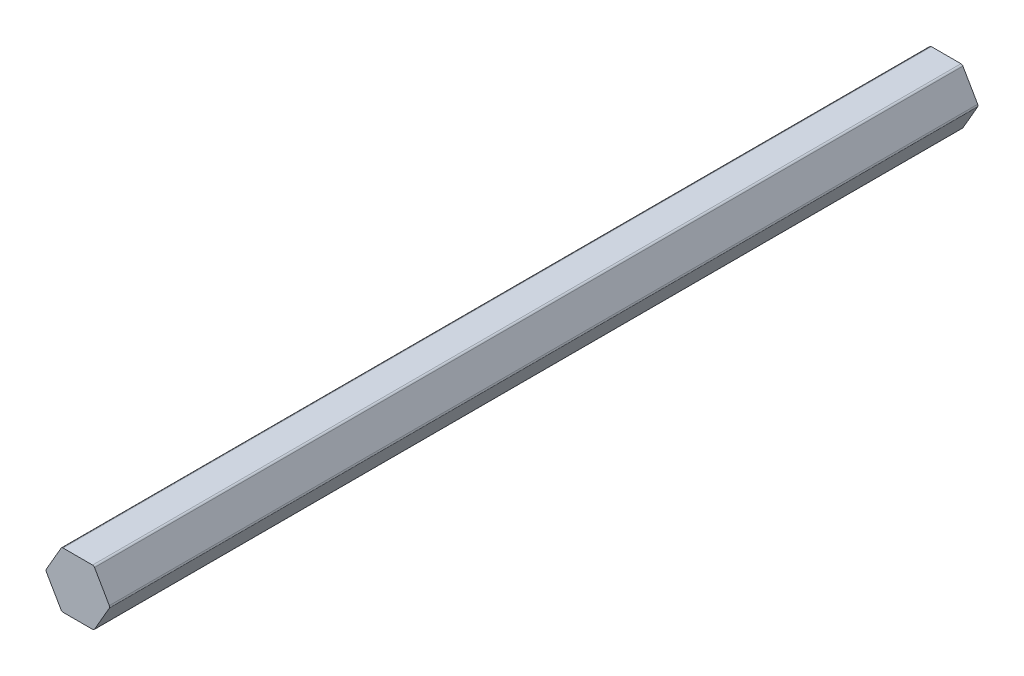
ISO-10303-21;
HEADER;
FILE_DESCRIPTION(('STEP AP214'),'2;1');
FILE_NAME('part.step','',(''),(''),'','','');
FILE_SCHEMA(('AUTOMOTIVE_DESIGN { 1 0 10303 214 1 1 1 1 }'));
ENDSEC;
DATA;
#1=APPLICATION_CONTEXT('core data for automotive mechanical design processes');
#2=APPLICATION_PROTOCOL_DEFINITION('international standard','automotive_design',2000,#1);
#3=PRODUCT_CONTEXT('',#1,'mechanical');
#4=PRODUCT('Part','Part','',(#3));
#5=PRODUCT_RELATED_PRODUCT_CATEGORY('part','',(#4));
#6=PRODUCT_DEFINITION_FORMATION('','',#4);
#7=PRODUCT_DEFINITION_CONTEXT('part definition',#1,'design');
#8=PRODUCT_DEFINITION('design','',#6,#7);
#9=PRODUCT_DEFINITION_SHAPE('','',#8);
#10=(LENGTH_UNIT() NAMED_UNIT(*) SI_UNIT(.MILLI.,.METRE.));
#11=(NAMED_UNIT(*) PLANE_ANGLE_UNIT() SI_UNIT($,.RADIAN.));
#12=(NAMED_UNIT(*) SI_UNIT($,.STERADIAN.) SOLID_ANGLE_UNIT());
#13=UNCERTAINTY_MEASURE_WITH_UNIT(LENGTH_MEASURE(1.E-05),#10,'distance_accuracy_value','');
#14=(GEOMETRIC_REPRESENTATION_CONTEXT(3) GLOBAL_UNCERTAINTY_ASSIGNED_CONTEXT((#13)) GLOBAL_UNIT_ASSIGNED_CONTEXT((#10,
#11,#12)) REPRESENTATION_CONTEXT('',''));
#15=CARTESIAN_POINT('',(0.,0.,0.));
#16=DIRECTION('',(0.,0.,1.));
#17=DIRECTION('',(1.,0.,0.));
#18=AXIS2_PLACEMENT_3D('',#15,#16,#17);
#19=CARTESIAN_POINT('',(-3.36554792418708,-5.8293,-30.988));
#20=DIRECTION('',(0.,0.,-1.));
#21=DIRECTION('',(-1.,0.,0.));
#22=AXIS2_PLACEMENT_3D('',#19,#20,#21);
#23=CYLINDRICAL_SURFACE('',#22,0.507999999999999);
#24=CARTESIAN_POINT('',(-3.36554792418708,-5.8293,-228.6));
#25=DIRECTION('',(0.,0.,-1.));
#26=DIRECTION('',(-1.,0.,0.));
#27=AXIS2_PLACEMENT_3D('',#24,#25,#26);
#28=CIRCLE('',#27,0.507999999999999);
#29=CARTESIAN_POINT('',(-3.36554792418708,-6.3373,-228.6));
#30=VERTEX_POINT('',#29);
#31=CARTESIAN_POINT('',(-3.80548882930957,-6.0833,-228.6));
#32=VERTEX_POINT('',#31);
#33=EDGE_CURVE('E154',#30,#32,#28,.T.);
#34=ORIENTED_EDGE('',*,*,#33,.F.);
#35=DIRECTION('',(0.,0.,-1.));
#36=VECTOR('',#35,1.);
#37=CARTESIAN_POINT('',(-3.36554792418708,-6.3373,-30.988));
#38=LINE('',#37,#36);
#39=CARTESIAN_POINT('',(-3.36554792418708,-6.3373,-30.988));
#40=VERTEX_POINT('',#39);
#41=EDGE_CURVE('E11',#40,#30,#38,.T.);
#42=ORIENTED_EDGE('',*,*,#41,.F.);
#43=CARTESIAN_POINT('',(-3.36554792418708,-5.8293,-30.988));
#44=DIRECTION('',(0.,0.,-1.));
#45=DIRECTION('',(-1.,0.,0.));
#46=AXIS2_PLACEMENT_3D('',#43,#44,#45);
#47=CIRCLE('',#46,0.507999999999999);
#48=CARTESIAN_POINT('',(-3.80548882930957,-6.0833,-30.988));
#49=VERTEX_POINT('',#48);
#50=EDGE_CURVE('E186',#40,#49,#47,.T.);
#51=ORIENTED_EDGE('',*,*,#50,.T.);
#52=DIRECTION('',(0.,0.,-1.));
#53=VECTOR('',#52,1.);
#54=CARTESIAN_POINT('',(-3.80548882930957,-6.0833,-30.988));
#55=LINE('',#54,#53);
#56=EDGE_CURVE('E36',#49,#32,#55,.T.);
#57=ORIENTED_EDGE('',*,*,#56,.T.);
#58=EDGE_LOOP('',(#34,#42,#51,#57));
#59=FACE_BOUND('',#58,.T.);
#60=ADVANCED_FACE('F33',(#59),#23,.T.);
#61=CARTESIAN_POINT('',(3.36554792418708,-6.3373,-30.988));
#62=DIRECTION('',(0.,-1.,0.));
#63=DIRECTION('',(1.,0.,0.));
#64=AXIS2_PLACEMENT_3D('',#61,#62,#63);
#65=PLANE('',#64);
#66=DIRECTION('',(-1.,0.,0.));
#67=VECTOR('',#66,1.);
#68=CARTESIAN_POINT('',(3.36554792418708,-6.3373,-228.6));
#69=LINE('',#68,#67);
#70=CARTESIAN_POINT('',(3.36554792418708,-6.3373,-228.6));
#71=VERTEX_POINT('',#70);
#72=EDGE_CURVE('E184',#71,#30,#69,.T.);
#73=ORIENTED_EDGE('',*,*,#72,.F.);
#74=DIRECTION('',(0.,0.,-1.));
#75=VECTOR('',#74,1.);
#76=CARTESIAN_POINT('',(3.36554792418708,-6.3373,-30.988));
#77=LINE('',#76,#75);
#78=CARTESIAN_POINT('',(3.36554792418708,-6.3373,-30.988));
#79=VERTEX_POINT('',#78);
#80=EDGE_CURVE('E42',#79,#71,#77,.T.);
#81=ORIENTED_EDGE('',*,*,#80,.F.);
#82=DIRECTION('',(-1.,0.,0.));
#83=VECTOR('',#82,1.);
#84=CARTESIAN_POINT('',(3.36554792418708,-6.3373,-30.988));
#85=LINE('',#84,#83);
#86=EDGE_CURVE('E144',#79,#40,#85,.T.);
#87=ORIENTED_EDGE('',*,*,#86,.T.);
#88=ORIENTED_EDGE('',*,*,#41,.T.);
#89=EDGE_LOOP('',(#73,#81,#87,#88));
#90=FACE_BOUND('',#89,.T.);
#91=ADVANCED_FACE('F206',(#90),#65,.T.);
#92=CARTESIAN_POINT('',(3.36554792418709,-5.8293,-30.988));
#93=DIRECTION('',(0.,0.,-1.));
#94=DIRECTION('',(-1.,0.,0.));
#95=AXIS2_PLACEMENT_3D('',#92,#93,#94);
#96=CYLINDRICAL_SURFACE('',#95,0.508);
#97=CARTESIAN_POINT('',(3.36554792418709,-5.8293,-228.6));
#98=DIRECTION('',(0.,0.,-1.));
#99=DIRECTION('',(-1.,0.,0.));
#100=AXIS2_PLACEMENT_3D('',#97,#98,#99);
#101=CIRCLE('',#100,0.508);
#102=CARTESIAN_POINT('',(3.80548882930958,-6.0833,-228.6));
#103=VERTEX_POINT('',#102);
#104=EDGE_CURVE('E131',#103,#71,#101,.T.);
#105=ORIENTED_EDGE('',*,*,#104,.F.);
#106=DIRECTION('',(0.,0.,-1.));
#107=VECTOR('',#106,1.);
#108=CARTESIAN_POINT('',(3.80548882930958,-6.0833,-30.988));
#109=LINE('',#108,#107);
#110=CARTESIAN_POINT('',(3.80548882930958,-6.0833,-30.988));
#111=VERTEX_POINT('',#110);
#112=EDGE_CURVE('E126',#111,#103,#109,.T.);
#113=ORIENTED_EDGE('',*,*,#112,.F.);
#114=CARTESIAN_POINT('',(3.36554792418709,-5.8293,-30.988));
#115=DIRECTION('',(0.,0.,-1.));
#116=DIRECTION('',(-1.,0.,0.));
#117=AXIS2_PLACEMENT_3D('',#114,#115,#116);
#118=CIRCLE('',#117,0.508);
#119=EDGE_CURVE('E129',#111,#79,#118,.T.);
#120=ORIENTED_EDGE('',*,*,#119,.T.);
#121=ORIENTED_EDGE('',*,*,#80,.T.);
#122=EDGE_LOOP('',(#105,#113,#120,#121));
#123=FACE_BOUND('',#122,.T.);
#124=ADVANCED_FACE('F128',(#123),#96,.T.);
#125=CARTESIAN_POINT('',(7.17103675349666,-0.253999999999997,-30.988));
#126=DIRECTION('',(0.866025403784439,-0.499999999999999,0.));
#127=DIRECTION('',(0.499999999999999,0.866025403784439,0.));
#128=AXIS2_PLACEMENT_3D('',#125,#126,#127);
#129=PLANE('',#128);
#130=DIRECTION('',(-0.499999999999999,-0.866025403784439,0.));
#131=VECTOR('',#130,1.);
#132=CARTESIAN_POINT('',(7.17103675349666,-0.253999999999997,-228.6));
#133=LINE('',#132,#131);
#134=CARTESIAN_POINT('',(7.17103675349666,-0.253999999999997,-228.6));
#135=VERTEX_POINT('',#134);
#136=EDGE_CURVE('E181',#135,#103,#133,.T.);
#137=ORIENTED_EDGE('',*,*,#136,.F.);
#138=DIRECTION('',(0.,0.,-1.));
#139=VECTOR('',#138,1.);
#140=CARTESIAN_POINT('',(7.17103675349666,-0.253999999999997,-30.988));
#141=LINE('',#140,#139);
#142=CARTESIAN_POINT('',(7.17103675349666,-0.253999999999997,-30.988));
#143=VERTEX_POINT('',#142);
#144=EDGE_CURVE('E136',#143,#135,#141,.T.);
#145=ORIENTED_EDGE('',*,*,#144,.F.);
#146=DIRECTION('',(-0.499999999999999,-0.866025403784439,0.));
#147=VECTOR('',#146,1.);
#148=CARTESIAN_POINT('',(7.17103675349666,-0.253999999999997,-30.988));
#149=LINE('',#148,#147);
#150=EDGE_CURVE('E142',#143,#111,#149,.T.);
#151=ORIENTED_EDGE('',*,*,#150,.T.);
#152=ORIENTED_EDGE('',*,*,#112,.T.);
#153=EDGE_LOOP('',(#137,#145,#151,#152));
#154=FACE_BOUND('',#153,.T.);
#155=ADVANCED_FACE('F146',(#154),#129,.T.);
#156=CARTESIAN_POINT('',(6.73109584837417,0.,-30.988));
#157=DIRECTION('',(0.,0.,-1.));
#158=DIRECTION('',(-1.,0.,0.));
#159=AXIS2_PLACEMENT_3D('',#156,#157,#158);
#160=CYLINDRICAL_SURFACE('',#159,0.507999999999999);
#161=CARTESIAN_POINT('',(6.73109584837417,0.,-228.6));
#162=DIRECTION('',(0.,0.,-1.));
#163=DIRECTION('',(-1.,0.,0.));
#164=AXIS2_PLACEMENT_3D('',#161,#162,#163);
#165=CIRCLE('',#164,0.507999999999999);
#166=CARTESIAN_POINT('',(7.17103675349666,0.254000000000003,-228.6));
#167=VERTEX_POINT('',#166);
#168=EDGE_CURVE('E178',#167,#135,#165,.T.);
#169=ORIENTED_EDGE('',*,*,#168,.F.);
#170=DIRECTION('',(0.,0.,-1.));
#171=VECTOR('',#170,1.);
#172=CARTESIAN_POINT('',(7.17103675349666,0.254000000000003,-30.988));
#173=LINE('',#172,#171);
#174=CARTESIAN_POINT('',(7.17103675349666,0.254000000000003,-30.988));
#175=VERTEX_POINT('',#174);
#176=EDGE_CURVE('E190',#175,#167,#173,.T.);
#177=ORIENTED_EDGE('',*,*,#176,.F.);
#178=CARTESIAN_POINT('',(6.73109584837417,0.,-30.988));
#179=DIRECTION('',(0.,0.,-1.));
#180=DIRECTION('',(-1.,0.,0.));
#181=AXIS2_PLACEMENT_3D('',#178,#179,#180);
#182=CIRCLE('',#181,0.507999999999999);
#183=EDGE_CURVE('E147',#175,#143,#182,.T.);
#184=ORIENTED_EDGE('',*,*,#183,.T.);
#185=ORIENTED_EDGE('',*,*,#144,.T.);
#186=EDGE_LOOP('',(#169,#177,#184,#185));
#187=FACE_BOUND('',#186,.T.);
#188=ADVANCED_FACE('F219',(#187),#160,.T.);
#189=CARTESIAN_POINT('',(3.80548882930958,6.0833,-30.988));
#190=DIRECTION('',(0.866025403784438,0.5,0.));
#191=DIRECTION('',(-0.5,0.866025403784439,0.));
#192=AXIS2_PLACEMENT_3D('',#189,#190,#191);
#193=PLANE('',#192);
#194=DIRECTION('',(0.5,-0.866025403784439,0.));
#195=VECTOR('',#194,1.);
#196=CARTESIAN_POINT('',(3.80548882930958,6.0833,-228.6));
#197=LINE('',#196,#195);
#198=CARTESIAN_POINT('',(3.80548882930958,6.0833,-228.6));
#199=VERTEX_POINT('',#198);
#200=EDGE_CURVE('E175',#199,#167,#197,.T.);
#201=ORIENTED_EDGE('',*,*,#200,.F.);
#202=DIRECTION('',(0.,0.,-1.));
#203=VECTOR('',#202,1.);
#204=CARTESIAN_POINT('',(3.80548882930958,6.0833,-30.988));
#205=LINE('',#204,#203);
#206=CARTESIAN_POINT('',(3.80548882930958,6.0833,-30.988));
#207=VERTEX_POINT('',#206);
#208=EDGE_CURVE('E192',#207,#199,#205,.T.);
#209=ORIENTED_EDGE('',*,*,#208,.F.);
#210=DIRECTION('',(0.5,-0.866025403784439,0.));
#211=VECTOR('',#210,1.);
#212=CARTESIAN_POINT('',(3.80548882930958,6.0833,-30.988));
#213=LINE('',#212,#211);
#214=EDGE_CURVE('E149',#207,#175,#213,.T.);
#215=ORIENTED_EDGE('',*,*,#214,.T.);
#216=ORIENTED_EDGE('',*,*,#176,.T.);
#217=EDGE_LOOP('',(#201,#209,#215,#216));
#218=FACE_BOUND('',#217,.T.);
#219=ADVANCED_FACE('F222',(#218),#193,.T.);
#220=CARTESIAN_POINT('',(3.36554792418708,5.8293,-30.988));
#221=DIRECTION('',(0.,0.,-1.));
#222=DIRECTION('',(-1.,0.,0.));
#223=AXIS2_PLACEMENT_3D('',#220,#221,#222);
#224=CYLINDRICAL_SURFACE('',#223,0.508);
#225=CARTESIAN_POINT('',(3.36554792418708,5.8293,-228.6));
#226=DIRECTION('',(0.,0.,-1.));
#227=DIRECTION('',(-1.,0.,0.));
#228=AXIS2_PLACEMENT_3D('',#225,#226,#227);
#229=CIRCLE('',#228,0.508);
#230=CARTESIAN_POINT('',(3.36554792418708,6.3373,-228.6));
#231=VERTEX_POINT('',#230);
#232=EDGE_CURVE('E172',#231,#199,#229,.T.);
#233=ORIENTED_EDGE('',*,*,#232,.F.);
#234=DIRECTION('',(0.,0.,-1.));
#235=VECTOR('',#234,1.);
#236=CARTESIAN_POINT('',(3.36554792418708,6.3373,-30.988));
#237=LINE('',#236,#235);
#238=CARTESIAN_POINT('',(3.36554792418708,6.3373,-30.988));
#239=VERTEX_POINT('',#238);
#240=EDGE_CURVE('E194',#239,#231,#237,.T.);
#241=ORIENTED_EDGE('',*,*,#240,.F.);
#242=CARTESIAN_POINT('',(3.36554792418708,5.8293,-30.988));
#243=DIRECTION('',(0.,0.,-1.));
#244=DIRECTION('',(-1.,0.,0.));
#245=AXIS2_PLACEMENT_3D('',#242,#243,#244);
#246=CIRCLE('',#245,0.508);
#247=EDGE_CURVE('E348',#239,#207,#246,.T.);
#248=ORIENTED_EDGE('',*,*,#247,.T.);
#249=ORIENTED_EDGE('',*,*,#208,.T.);
#250=EDGE_LOOP('',(#233,#241,#248,#249));
#251=FACE_BOUND('',#250,.T.);
#252=ADVANCED_FACE('F226',(#251),#224,.T.);
#253=CARTESIAN_POINT('',(-3.36554792418708,6.3373,-30.988));
#254=DIRECTION('',(0.,1.,0.));
#255=DIRECTION('',(-1.,0.,0.));
#256=AXIS2_PLACEMENT_3D('',#253,#254,#255);
#257=PLANE('',#256);
#258=DIRECTION('',(1.,0.,0.));
#259=VECTOR('',#258,1.);
#260=CARTESIAN_POINT('',(-3.36554792418708,6.3373,-228.6));
#261=LINE('',#260,#259);
#262=CARTESIAN_POINT('',(-3.36554792418708,6.3373,-228.6));
#263=VERTEX_POINT('',#262);
#264=EDGE_CURVE('E169',#263,#231,#261,.T.);
#265=ORIENTED_EDGE('',*,*,#264,.F.);
#266=DIRECTION('',(0.,0.,-1.));
#267=VECTOR('',#266,1.);
#268=CARTESIAN_POINT('',(-3.36554792418708,6.3373,-30.988));
#269=LINE('',#268,#267);
#270=CARTESIAN_POINT('',(-3.36554792418708,6.3373,-30.988));
#271=VERTEX_POINT('',#270);
#272=EDGE_CURVE('E196',#271,#263,#269,.T.);
#273=ORIENTED_EDGE('',*,*,#272,.F.);
#274=DIRECTION('',(1.,0.,0.));
#275=VECTOR('',#274,1.);
#276=CARTESIAN_POINT('',(-3.36554792418708,6.3373,-30.988));
#277=LINE('',#276,#275);
#278=EDGE_CURVE('E352',#271,#239,#277,.T.);
#279=ORIENTED_EDGE('',*,*,#278,.T.);
#280=ORIENTED_EDGE('',*,*,#240,.T.);
#281=EDGE_LOOP('',(#265,#273,#279,#280));
#282=FACE_BOUND('',#281,.T.);
#283=ADVANCED_FACE('F230',(#282),#257,.T.);
#284=CARTESIAN_POINT('',(-3.36554792418708,5.8293,-30.988));
#285=DIRECTION('',(0.,0.,-1.));
#286=DIRECTION('',(-1.,0.,0.));
#287=AXIS2_PLACEMENT_3D('',#284,#285,#286);
#288=CYLINDRICAL_SURFACE('',#287,0.508000000000003);
#289=CARTESIAN_POINT('',(-3.36554792418708,5.8293,-228.6));
#290=DIRECTION('',(0.,0.,-1.));
#291=DIRECTION('',(-1.,0.,0.));
#292=AXIS2_PLACEMENT_3D('',#289,#290,#291);
#293=CIRCLE('',#292,0.508000000000003);
#294=CARTESIAN_POINT('',(-3.80548882930957,6.08330000000001,-228.6));
#295=VERTEX_POINT('',#294);
#296=EDGE_CURVE('E166',#295,#263,#293,.T.);
#297=ORIENTED_EDGE('',*,*,#296,.F.);
#298=DIRECTION('',(0.,0.,-1.));
#299=VECTOR('',#298,1.);
#300=CARTESIAN_POINT('',(-3.80548882930957,6.08330000000001,-30.988));
#301=LINE('',#300,#299);
#302=CARTESIAN_POINT('',(-3.80548882930957,6.08330000000001,-30.988));
#303=VERTEX_POINT('',#302);
#304=EDGE_CURVE('E198',#303,#295,#301,.T.);
#305=ORIENTED_EDGE('',*,*,#304,.F.);
#306=CARTESIAN_POINT('',(-3.36554792418708,5.8293,-30.988));
#307=DIRECTION('',(0.,0.,-1.));
#308=DIRECTION('',(-1.,0.,0.));
#309=AXIS2_PLACEMENT_3D('',#306,#307,#308);
#310=CIRCLE('',#309,0.508000000000003);
#311=EDGE_CURVE('E341',#303,#271,#310,.T.);
#312=ORIENTED_EDGE('',*,*,#311,.T.);
#313=ORIENTED_EDGE('',*,*,#272,.T.);
#314=EDGE_LOOP('',(#297,#305,#312,#313));
#315=FACE_BOUND('',#314,.T.);
#316=ADVANCED_FACE('F234',(#315),#288,.T.);
#317=CARTESIAN_POINT('',(-7.17103675349666,0.254000000000003,-30.988));
#318=DIRECTION('',(-0.866025403784439,0.499999999999999,0.));
#319=DIRECTION('',(-0.499999999999999,-0.866025403784439,0.));
#320=AXIS2_PLACEMENT_3D('',#317,#318,#319);
#321=PLANE('',#320);
#322=DIRECTION('',(0.499999999999999,0.866025403784439,0.));
#323=VECTOR('',#322,1.);
#324=CARTESIAN_POINT('',(-7.17103675349666,0.254000000000003,-228.6));
#325=LINE('',#324,#323);
#326=CARTESIAN_POINT('',(-7.17103675349666,0.254000000000003,-228.6));
#327=VERTEX_POINT('',#326);
#328=EDGE_CURVE('E163',#327,#295,#325,.T.);
#329=ORIENTED_EDGE('',*,*,#328,.F.);
#330=DIRECTION('',(0.,0.,-1.));
#331=VECTOR('',#330,1.);
#332=CARTESIAN_POINT('',(-7.17103675349666,0.254000000000003,-30.988));
#333=LINE('',#332,#331);
#334=CARTESIAN_POINT('',(-7.17103675349666,0.254000000000003,-30.988));
#335=VERTEX_POINT('',#334);
#336=EDGE_CURVE('E200',#335,#327,#333,.T.);
#337=ORIENTED_EDGE('',*,*,#336,.F.);
#338=DIRECTION('',(0.499999999999999,0.866025403784439,0.));
#339=VECTOR('',#338,1.);
#340=CARTESIAN_POINT('',(-7.17103675349666,0.254000000000003,-30.988));
#341=LINE('',#340,#339);
#342=EDGE_CURVE('E337',#335,#303,#341,.T.);
#343=ORIENTED_EDGE('',*,*,#342,.T.);
#344=ORIENTED_EDGE('',*,*,#304,.T.);
#345=EDGE_LOOP('',(#329,#337,#343,#344));
#346=FACE_BOUND('',#345,.T.);
#347=ADVANCED_FACE('F238',(#346),#321,.T.);
#348=CARTESIAN_POINT('',(-6.73109584837417,0.,-30.988));
#349=DIRECTION('',(0.,0.,-1.));
#350=DIRECTION('',(-1.,0.,0.));
#351=AXIS2_PLACEMENT_3D('',#348,#349,#350);
#352=CYLINDRICAL_SURFACE('',#351,0.508000000000001);
#353=CARTESIAN_POINT('',(-6.73109584837417,0.,-228.6));
#354=DIRECTION('',(0.,0.,-1.));
#355=DIRECTION('',(-1.,0.,0.));
#356=AXIS2_PLACEMENT_3D('',#353,#354,#355);
#357=CIRCLE('',#356,0.508000000000001);
#358=CARTESIAN_POINT('',(-7.17103675349666,-0.254000000000005,-228.6));
#359=VERTEX_POINT('',#358);
#360=EDGE_CURVE('E160',#359,#327,#357,.T.);
#361=ORIENTED_EDGE('',*,*,#360,.F.);
#362=DIRECTION('',(0.,0.,-1.));
#363=VECTOR('',#362,1.);
#364=CARTESIAN_POINT('',(-7.17103675349666,-0.254000000000005,-30.988));
#365=LINE('',#364,#363);
#366=CARTESIAN_POINT('',(-7.17103675349666,-0.254000000000005,-30.988));
#367=VERTEX_POINT('',#366);
#368=EDGE_CURVE('E201',#367,#359,#365,.T.);
#369=ORIENTED_EDGE('',*,*,#368,.F.);
#370=CARTESIAN_POINT('',(-6.73109584837417,0.,-30.988));
#371=DIRECTION('',(0.,0.,-1.));
#372=DIRECTION('',(-1.,0.,0.));
#373=AXIS2_PLACEMENT_3D('',#370,#371,#372);
#374=CIRCLE('',#373,0.508000000000001);
#375=EDGE_CURVE('E358',#367,#335,#374,.T.);
#376=ORIENTED_EDGE('',*,*,#375,.T.);
#377=ORIENTED_EDGE('',*,*,#336,.T.);
#378=EDGE_LOOP('',(#361,#369,#376,#377));
#379=FACE_BOUND('',#378,.T.);
#380=ADVANCED_FACE('F242',(#379),#352,.T.);
#381=CARTESIAN_POINT('',(-3.80548882930957,-6.0833,-30.988));
#382=DIRECTION('',(-0.866025403784438,-0.5,0.));
#383=DIRECTION('',(0.5,-0.866025403784438,0.));
#384=AXIS2_PLACEMENT_3D('',#381,#382,#383);
#385=PLANE('',#384);
#386=DIRECTION('',(-0.500000000000001,0.866025403784438,0.));
#387=VECTOR('',#386,1.);
#388=CARTESIAN_POINT('',(-3.80548882930957,-6.0833,-228.6));
#389=LINE('',#388,#387);
#390=EDGE_CURVE('E157',#32,#359,#389,.T.);
#391=ORIENTED_EDGE('',*,*,#390,.F.);
#392=ORIENTED_EDGE('',*,*,#56,.F.);
#393=DIRECTION('',(-0.500000000000001,0.866025403784438,0.));
#394=VECTOR('',#393,1.);
#395=CARTESIAN_POINT('',(-3.80548882930957,-6.0833,-30.988));
#396=LINE('',#395,#394);
#397=EDGE_CURVE('E360',#49,#367,#396,.T.);
#398=ORIENTED_EDGE('',*,*,#397,.T.);
#399=ORIENTED_EDGE('',*,*,#368,.T.);
#400=EDGE_LOOP('',(#391,#392,#398,#399));
#401=FACE_BOUND('',#400,.T.);
#402=ADVANCED_FACE('F203',(#401),#385,.T.);
#403=CARTESIAN_POINT('',(-3.36554792418708,-5.8293,-30.988));
#404=DIRECTION('',(0.,0.,-1.));
#405=DIRECTION('',(-1.,0.,0.));
#406=AXIS2_PLACEMENT_3D('',#403,#404,#405);
#407=PLANE('',#406);
#408=ORIENTED_EDGE('',*,*,#50,.F.);
#409=ORIENTED_EDGE('',*,*,#86,.F.);
#410=ORIENTED_EDGE('',*,*,#119,.F.);
#411=ORIENTED_EDGE('',*,*,#150,.F.);
#412=ORIENTED_EDGE('',*,*,#183,.F.);
#413=ORIENTED_EDGE('',*,*,#214,.F.);
#414=ORIENTED_EDGE('',*,*,#247,.F.);
#415=ORIENTED_EDGE('',*,*,#278,.F.);
#416=ORIENTED_EDGE('',*,*,#311,.F.);
#417=ORIENTED_EDGE('',*,*,#342,.F.);
#418=ORIENTED_EDGE('',*,*,#375,.F.);
#419=ORIENTED_EDGE('',*,*,#397,.F.);
#420=EDGE_LOOP('',(#408,#409,#410,#411,#412,#413,#414,#415,#416,#417,#418,#419));
#421=FACE_BOUND('',#420,.T.);
#422=ADVANCED_FACE('F140',(#421),#407,.F.);
#423=CARTESIAN_POINT('',(-3.36554792418708,-5.8293,-228.6));
#424=DIRECTION('',(0.,0.,-1.));
#425=DIRECTION('',(-1.,0.,0.));
#426=AXIS2_PLACEMENT_3D('',#423,#424,#425);
#427=PLANE('',#426);
#428=ORIENTED_EDGE('',*,*,#33,.T.);
#429=ORIENTED_EDGE('',*,*,#390,.T.);
#430=ORIENTED_EDGE('',*,*,#360,.T.);
#431=ORIENTED_EDGE('',*,*,#328,.T.);
#432=ORIENTED_EDGE('',*,*,#296,.T.);
#433=ORIENTED_EDGE('',*,*,#264,.T.);
#434=ORIENTED_EDGE('',*,*,#232,.T.);
#435=ORIENTED_EDGE('',*,*,#200,.T.);
#436=ORIENTED_EDGE('',*,*,#168,.T.);
#437=ORIENTED_EDGE('',*,*,#136,.T.);
#438=ORIENTED_EDGE('',*,*,#104,.T.);
#439=ORIENTED_EDGE('',*,*,#72,.T.);
#440=EDGE_LOOP('',(#428,#429,#430,#431,#432,#433,#434,#435,#436,#437,#438,#439));
#441=FACE_BOUND('',#440,.T.);
#442=ADVANCED_FACE('F205',(#441),#427,.T.);
#443=CLOSED_SHELL('',(#60,#91,#124,#155,#188,#219,#252,#283,#316,#347,#380,#402,#422,#442));
#444=MANIFOLD_SOLID_BREP('B2',#443);
#445=ADVANCED_BREP_SHAPE_REPRESENTATION('',(#18,#444),#14);
#446=SHAPE_DEFINITION_REPRESENTATION(#9,#445);
ENDSEC;
END-ISO-10303-21;
